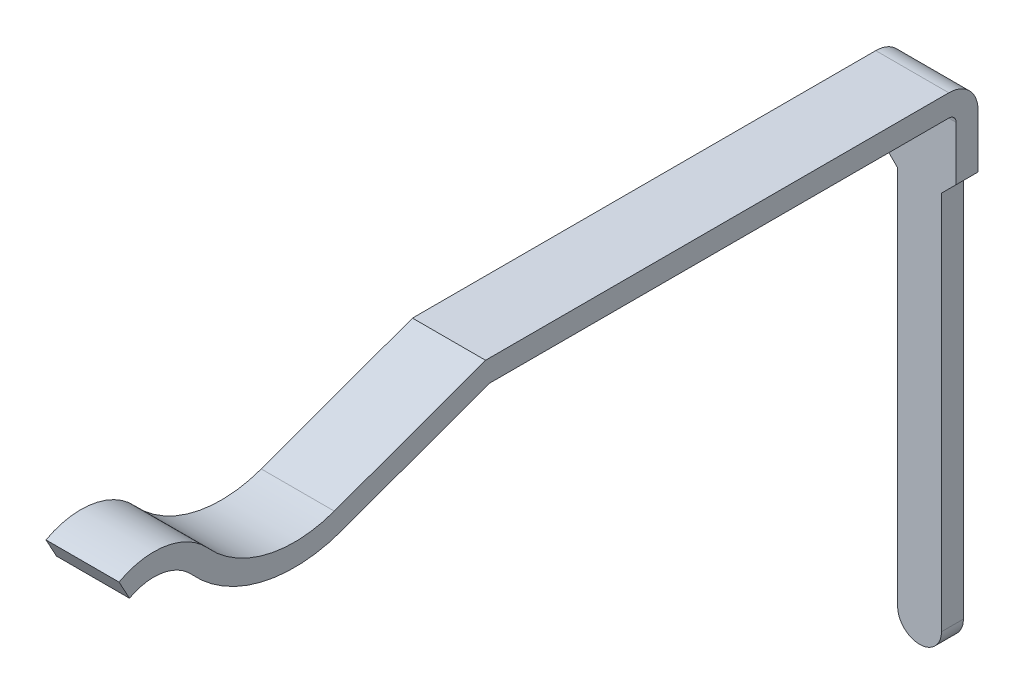
ISO-10303-21;
HEADER;
FILE_DESCRIPTION(('STEP AP214'),'2;1');
FILE_NAME('part.step','',(''),(''),'','','');
FILE_SCHEMA(('AUTOMOTIVE_DESIGN { 1 0 10303 214 1 1 1 1 }'));
ENDSEC;
DATA;
#1=APPLICATION_CONTEXT('core data for automotive mechanical design processes');
#2=APPLICATION_PROTOCOL_DEFINITION('international standard','automotive_design',2000,#1);
#3=PRODUCT_CONTEXT('',#1,'mechanical');
#4=PRODUCT('Part','Part','',(#3));
#5=PRODUCT_RELATED_PRODUCT_CATEGORY('part','',(#4));
#6=PRODUCT_DEFINITION_FORMATION('','',#4);
#7=PRODUCT_DEFINITION_CONTEXT('part definition',#1,'design');
#8=PRODUCT_DEFINITION('design','',#6,#7);
#9=PRODUCT_DEFINITION_SHAPE('','',#8);
#10=(LENGTH_UNIT() NAMED_UNIT(*) SI_UNIT(.MILLI.,.METRE.));
#11=(NAMED_UNIT(*) PLANE_ANGLE_UNIT() SI_UNIT($,.RADIAN.));
#12=(NAMED_UNIT(*) SI_UNIT($,.STERADIAN.) SOLID_ANGLE_UNIT());
#13=UNCERTAINTY_MEASURE_WITH_UNIT(LENGTH_MEASURE(1.E-05),#10,'distance_accuracy_value','');
#14=(GEOMETRIC_REPRESENTATION_CONTEXT(3) GLOBAL_UNCERTAINTY_ASSIGNED_CONTEXT((#13)) GLOBAL_UNIT_ASSIGNED_CONTEXT((#10,
#11,#12)) REPRESENTATION_CONTEXT('',''));
#15=CARTESIAN_POINT('',(0.,0.,0.));
#16=DIRECTION('',(0.,0.,1.));
#17=DIRECTION('',(1.,0.,0.));
#18=AXIS2_PLACEMENT_3D('',#15,#16,#17);
#19=CARTESIAN_POINT('',(-0.5,-1.14,-12.76));
#20=DIRECTION('',(-1.,0.,0.));
#21=DIRECTION('',(0.,0.,1.));
#22=AXIS2_PLACEMENT_3D('',#19,#20,#21);
#23=PLANE('',#22);
#24=DIRECTION('',(0.,-0.342020143057909,0.939692620883365));
#25=VECTOR('',#24,1.);
#26=CARTESIAN_POINT('',(-0.5,-0.6677079895,-5.060107671));
#27=LINE('',#26,#25);
#28=CARTESIAN_POINT('',(-0.5,-0.3,-6.07037707));
#29=VERTEX_POINT('',#28);
#30=CARTESIAN_POINT('',(-0.5,-1.03541597932143,-4.04983827195384));
#31=VERTEX_POINT('',#30);
#32=EDGE_CURVE('E219',#29,#31,#27,.T.);
#33=ORIENTED_EDGE('',*,*,#32,.T.);
#34=CARTESIAN_POINT('',(-0.5,0.75,-3.4));
#35=DIRECTION('',(-1.,0.,0.));
#36=DIRECTION('',(0.,0.,1.));
#37=AXIS2_PLACEMENT_3D('',#34,#35,#36);
#38=CIRCLE('',#37,1.9);
#39=CARTESIAN_POINT('',(-0.5,-0.528846153737504,-1.99481228475666));
#40=VERTEX_POINT('',#39);
#41=EDGE_CURVE('E313',#31,#40,#38,.T.);
#42=ORIENTED_EDGE('',*,*,#41,.T.);
#43=CARTESIAN_POINT('',(-0.5,-1.,-1.477111548));
#44=DIRECTION('',(-1.,0.,0.));
#45=DIRECTION('',(0.,0.,1.));
#46=AXIS2_PLACEMENT_3D('',#43,#44,#45);
#47=CIRCLE('',#46,0.7);
#48=CARTESIAN_POINT('',(-0.5,-0.384810078226828,-1.14313346412314));
#49=VERTEX_POINT('',#48);
#50=EDGE_CURVE('E275',#49,#40,#47,.T.);
#51=ORIENTED_EDGE('',*,*,#50,.F.);
#52=DIRECTION('',(0.,-0.878842745322893,-0.477111547746772));
#53=VECTOR('',#52,1.);
#54=CARTESIAN_POINT('',(-0.5,-0.2529836665,-1.071566732));
#55=LINE('',#54,#53);
#56=CARTESIAN_POINT('',(-0.5,-0.121157254764434,-1.00000000009237));
#57=VERTEX_POINT('',#56);
#58=EDGE_CURVE('E253',#57,#49,#55,.T.);
#59=ORIENTED_EDGE('',*,*,#58,.F.);
#60=CARTESIAN_POINT('',(-0.5,-1.,-1.477111548));
#61=DIRECTION('',(-1.,0.,0.));
#62=DIRECTION('',(0.,0.,1.));
#63=AXIS2_PLACEMENT_3D('',#60,#61,#62);
#64=CIRCLE('',#63,1.);
#65=CARTESIAN_POINT('',(-0.5,-0.326923076831582,-2.21668402926877));
#66=VERTEX_POINT('',#65);
#67=EDGE_CURVE('E250',#57,#66,#64,.T.);
#68=ORIENTED_EDGE('',*,*,#67,.T.);
#69=CARTESIAN_POINT('',(-0.5,0.75,-3.4));
#70=DIRECTION('',(-1.,0.,0.));
#71=DIRECTION('',(0.,0.,1.));
#72=AXIS2_PLACEMENT_3D('',#69,#70,#71);
#73=CIRCLE('',#72,1.6);
#74=CARTESIAN_POINT('',(-0.5,-0.753508193021166,-3.94723222894185));
#75=VERTEX_POINT('',#74);
#76=EDGE_CURVE('E246',#75,#66,#73,.T.);
#77=ORIENTED_EDGE('',*,*,#76,.F.);
#78=DIRECTION('',(0.,-0.342020143127497,0.939692620858037));
#79=VECTOR('',#78,1.);
#80=CARTESIAN_POINT('',(-0.5,-0.3767540965,-4.9823556025));
#81=LINE('',#80,#79);
#82=CARTESIAN_POINT('',(-0.5,0.,-6.017478976));
#83=VERTEX_POINT('',#82);
#84=EDGE_CURVE('E243',#83,#75,#81,.T.);
#85=ORIENTED_EDGE('',*,*,#84,.F.);
#86=DIRECTION('',(0.,0.,1.));
#87=VECTOR('',#86,1.);
#88=CARTESIAN_POINT('',(-0.5,0.,-9.188739488));
#89=LINE('',#88,#87);
#90=CARTESIAN_POINT('',(-0.5,0.,-12.360000000041));
#91=VERTEX_POINT('',#90);
#92=EDGE_CURVE('E238',#91,#83,#89,.T.);
#93=ORIENTED_EDGE('',*,*,#92,.F.);
#94=CARTESIAN_POINT('',(-0.5,-0.4,-12.36));
#95=DIRECTION('',(-1.,0.,0.));
#96=DIRECTION('',(0.,0.,1.));
#97=AXIS2_PLACEMENT_3D('',#94,#95,#96);
#98=CIRCLE('',#97,0.399999999999999);
#99=CARTESIAN_POINT('',(-0.5,-0.4,-12.76));
#100=VERTEX_POINT('',#99);
#101=EDGE_CURVE('E21',#91,#100,#98,.T.);
#102=ORIENTED_EDGE('',*,*,#101,.T.);
#103=DIRECTION('',(0.,-1.,0.));
#104=VECTOR('',#103,1.);
#105=CARTESIAN_POINT('',(-0.5,-0.5643,-12.76));
#106=LINE('',#105,#104);
#107=CARTESIAN_POINT('',(-0.50000000015034,-1.13999999984966,-12.76));
#108=VERTEX_POINT('',#107);
#109=EDGE_CURVE('E129',#100,#108,#106,.T.);
#110=ORIENTED_EDGE('',*,*,#109,.T.);
#111=DIRECTION('',(0.,0.,1.));
#112=VECTOR('',#111,1.);
#113=CARTESIAN_POINT('',(-0.5,-1.14,-6.84472));
#114=LINE('',#113,#112);
#115=CARTESIAN_POINT('',(-0.5,-1.14,-12.4599999985043));
#116=VERTEX_POINT('',#115);
#117=EDGE_CURVE('E264',#108,#116,#114,.T.);
#118=ORIENTED_EDGE('',*,*,#117,.T.);
#119=DIRECTION('',(0.,1.,0.));
#120=VECTOR('',#119,1.);
#121=CARTESIAN_POINT('',(-0.5,-0.5643,-12.4599999970086));
#122=LINE('',#121,#120);
#123=CARTESIAN_POINT('',(-0.5,-0.4,-12.4599999985043));
#124=VERTEX_POINT('',#123);
#125=EDGE_CURVE('E261',#116,#124,#122,.T.);
#126=ORIENTED_EDGE('',*,*,#125,.T.);
#127=CARTESIAN_POINT('',(-0.5,-0.4,-12.36));
#128=DIRECTION('',(-1.,0.,0.));
#129=DIRECTION('',(0.,0.,1.));
#130=AXIS2_PLACEMENT_3D('',#127,#128,#129);
#131=CIRCLE('',#130,0.100000000000001);
#132=CARTESIAN_POINT('',(-0.5,-0.3,-12.36));
#133=VERTEX_POINT('',#132);
#134=EDGE_CURVE('E263',#124,#133,#131,.F.);
#135=ORIENTED_EDGE('',*,*,#134,.T.);
#136=DIRECTION('',(0.,0.,1.));
#137=VECTOR('',#136,1.);
#138=CARTESIAN_POINT('',(-0.5,-0.3,-9.215188535));
#139=LINE('',#138,#137);
#140=EDGE_CURVE('E223',#133,#29,#139,.T.);
#141=ORIENTED_EDGE('',*,*,#140,.T.);
#142=EDGE_LOOP('',(#33,#42,#51,#59,#68,#77,#85,#93,#102,#110,#118,#126,#135,#141));
#143=FACE_BOUND('',#142,.T.);
#144=ADVANCED_FACE('F17',(#143),#23,.T.);
#145=CARTESIAN_POINT('',(0.5,-1.,-1.477111548));
#146=DIRECTION('',(-1.,0.,0.));
#147=DIRECTION('',(0.,0.,1.));
#148=AXIS2_PLACEMENT_3D('',#145,#146,#147);
#149=CYLINDRICAL_SURFACE('',#148,0.7);
#150=CARTESIAN_POINT('',(0.5,-1.,-1.477111548));
#151=DIRECTION('',(-1.,0.,0.));
#152=DIRECTION('',(0.,0.,1.));
#153=AXIS2_PLACEMENT_3D('',#150,#151,#152);
#154=CIRCLE('',#153,0.7);
#155=CARTESIAN_POINT('',(0.5,-0.528846153662103,-1.99481228483951));
#156=VERTEX_POINT('',#155);
#157=CARTESIAN_POINT('',(0.5,-0.384810078226828,-1.14313346412314));
#158=VERTEX_POINT('',#157);
#159=EDGE_CURVE('E236',#156,#158,#154,.F.);
#160=ORIENTED_EDGE('',*,*,#159,.T.);
#161=DIRECTION('',(1.,0.,0.));
#162=VECTOR('',#161,1.);
#163=CARTESIAN_POINT('',(0.,-0.384810078,-1.143133464));
#164=LINE('',#163,#162);
#165=EDGE_CURVE('E251',#49,#158,#164,.T.);
#166=ORIENTED_EDGE('',*,*,#165,.F.);
#167=ORIENTED_EDGE('',*,*,#50,.T.);
#168=DIRECTION('',(-1.,0.,0.));
#169=VECTOR('',#168,1.);
#170=CARTESIAN_POINT('',(0.,-0.528846153518653,-1.99481228455749));
#171=LINE('',#170,#169);
#172=EDGE_CURVE('E212',#40,#156,#171,.F.);
#173=ORIENTED_EDGE('',*,*,#172,.T.);
#174=EDGE_LOOP('',(#160,#166,#167,#173));
#175=FACE_BOUND('',#174,.T.);
#176=ADVANCED_FACE('F337',(#175),#149,.F.);
#177=CARTESIAN_POINT('',(-0.5,-0.121157255,-1.));
#178=DIRECTION('',(0.,-0.477111547746772,0.878842745322893));
#179=DIRECTION('',(0.,-0.878842745322893,-0.477111547746772));
#180=AXIS2_PLACEMENT_3D('',#177,#178,#179);
#181=PLANE('',#180);
#182=DIRECTION('',(0.,-0.878842745322893,-0.477111547746772));
#183=VECTOR('',#182,1.);
#184=CARTESIAN_POINT('',(0.5,-0.121157255,-1.));
#185=LINE('',#184,#183);
#186=CARTESIAN_POINT('',(0.5,-0.121157254764434,-1.00000000009237));
#187=VERTEX_POINT('',#186);
#188=EDGE_CURVE('E303',#158,#187,#185,.F.);
#189=ORIENTED_EDGE('',*,*,#188,.T.);
#190=DIRECTION('',(1.,0.,0.));
#191=VECTOR('',#190,1.);
#192=CARTESIAN_POINT('',(0.,-0.121157254672079,-1.00000000026249));
#193=LINE('',#192,#191);
#194=EDGE_CURVE('E247',#187,#57,#193,.F.);
#195=ORIENTED_EDGE('',*,*,#194,.T.);
#196=ORIENTED_EDGE('',*,*,#58,.T.);
#197=ORIENTED_EDGE('',*,*,#165,.T.);
#198=EDGE_LOOP('',(#189,#195,#196,#197));
#199=FACE_BOUND('',#198,.T.);
#200=ADVANCED_FACE('F377',(#199),#181,.T.);
#201=CARTESIAN_POINT('',(0.5,-1.,-1.477111548));
#202=DIRECTION('',(-1.,0.,0.));
#203=DIRECTION('',(0.,0.,1.));
#204=AXIS2_PLACEMENT_3D('',#201,#202,#203);
#205=CYLINDRICAL_SURFACE('',#204,1.);
#206=ORIENTED_EDGE('',*,*,#194,.F.);
#207=CARTESIAN_POINT('',(0.5,-1.,-1.477111548));
#208=DIRECTION('',(-1.,0.,0.));
#209=DIRECTION('',(0.,0.,1.));
#210=AXIS2_PLACEMENT_3D('',#207,#208,#209);
#211=CIRCLE('',#210,1.);
#212=CARTESIAN_POINT('',(0.5,-0.326923076831582,-2.21668402926877));
#213=VERTEX_POINT('',#212);
#214=EDGE_CURVE('E300',#187,#213,#211,.T.);
#215=ORIENTED_EDGE('',*,*,#214,.T.);
#216=DIRECTION('',(-1.,0.,0.));
#217=VECTOR('',#216,1.);
#218=CARTESIAN_POINT('',(0.,-0.326923076647287,-2.21668402910104));
#219=LINE('',#218,#217);
#220=EDGE_CURVE('E244',#66,#213,#219,.F.);
#221=ORIENTED_EDGE('',*,*,#220,.F.);
#222=ORIENTED_EDGE('',*,*,#67,.F.);
#223=EDGE_LOOP('',(#206,#215,#221,#222));
#224=FACE_BOUND('',#223,.T.);
#225=ADVANCED_FACE('F374',(#224),#205,.T.);
#226=CARTESIAN_POINT('',(0.5,0.75,-3.4));
#227=DIRECTION('',(-1.,0.,0.));
#228=DIRECTION('',(0.,0.,1.));
#229=AXIS2_PLACEMENT_3D('',#226,#227,#228);
#230=CYLINDRICAL_SURFACE('',#229,1.6);
#231=CARTESIAN_POINT('',(0.5,0.75,-3.4));
#232=DIRECTION('',(-1.,0.,0.));
#233=DIRECTION('',(0.,0.,1.));
#234=AXIS2_PLACEMENT_3D('',#231,#232,#233);
#235=CIRCLE('',#234,1.6);
#236=CARTESIAN_POINT('',(0.5,-0.753508193021166,-3.94723222894185));
#237=VERTEX_POINT('',#236);
#238=EDGE_CURVE('E297',#213,#237,#235,.F.);
#239=ORIENTED_EDGE('',*,*,#238,.T.);
#240=DIRECTION('',(1.,0.,0.));
#241=VECTOR('',#240,1.);
#242=CARTESIAN_POINT('',(0.,-0.753508193,-3.947232229));
#243=LINE('',#242,#241);
#244=EDGE_CURVE('E241',#75,#237,#243,.T.);
#245=ORIENTED_EDGE('',*,*,#244,.F.);
#246=ORIENTED_EDGE('',*,*,#76,.T.);
#247=ORIENTED_EDGE('',*,*,#220,.T.);
#248=EDGE_LOOP('',(#239,#245,#246,#247));
#249=FACE_BOUND('',#248,.T.);
#250=ADVANCED_FACE('F370',(#249),#230,.F.);
#251=CARTESIAN_POINT('',(-0.5,0.,-6.017478976));
#252=DIRECTION('',(0.,0.939692620858037,0.342020143127497));
#253=DIRECTION('',(0.,-0.342020143127497,0.939692620858037));
#254=AXIS2_PLACEMENT_3D('',#251,#252,#253);
#255=PLANE('',#254);
#256=DIRECTION('',(0.,-0.342020143127497,0.939692620858037));
#257=VECTOR('',#256,1.);
#258=CARTESIAN_POINT('',(0.5,0.,-6.017478976));
#259=LINE('',#258,#257);
#260=CARTESIAN_POINT('',(0.5,0.,-6.017478976));
#261=VERTEX_POINT('',#260);
#262=EDGE_CURVE('E206',#237,#261,#259,.F.);
#263=ORIENTED_EDGE('',*,*,#262,.T.);
#264=DIRECTION('',(1.,0.,0.));
#265=VECTOR('',#264,1.);
#266=CARTESIAN_POINT('',(0.,0.,-6.017478976));
#267=LINE('',#266,#265);
#268=EDGE_CURVE('E229',#83,#261,#267,.T.);
#269=ORIENTED_EDGE('',*,*,#268,.F.);
#270=ORIENTED_EDGE('',*,*,#84,.T.);
#271=ORIENTED_EDGE('',*,*,#244,.T.);
#272=EDGE_LOOP('',(#263,#269,#270,#271));
#273=FACE_BOUND('',#272,.T.);
#274=ADVANCED_FACE('F364',(#273),#255,.T.);
#275=CARTESIAN_POINT('',(-0.5,0.,-12.36));
#276=DIRECTION('',(0.,1.,0.));
#277=DIRECTION('',(0.,0.,1.));
#278=AXIS2_PLACEMENT_3D('',#275,#276,#277);
#279=PLANE('',#278);
#280=DIRECTION('',(0.,0.,-1.));
#281=VECTOR('',#280,1.);
#282=CARTESIAN_POINT('',(0.5,0.,-6.84472));
#283=LINE('',#282,#281);
#284=CARTESIAN_POINT('',(0.5,0.,-12.360000000041));
#285=VERTEX_POINT('',#284);
#286=EDGE_CURVE('E202',#261,#285,#283,.T.);
#287=ORIENTED_EDGE('',*,*,#286,.T.);
#288=DIRECTION('',(1.,0.,0.));
#289=VECTOR('',#288,1.);
#290=CARTESIAN_POINT('',(0.,0.,-12.360000000082));
#291=LINE('',#290,#289);
#292=EDGE_CURVE('E215',#285,#91,#291,.F.);
#293=ORIENTED_EDGE('',*,*,#292,.T.);
#294=ORIENTED_EDGE('',*,*,#92,.T.);
#295=ORIENTED_EDGE('',*,*,#268,.T.);
#296=EDGE_LOOP('',(#287,#293,#294,#295));
#297=FACE_BOUND('',#296,.T.);
#298=ADVANCED_FACE('F360',(#297),#279,.T.);
#299=CARTESIAN_POINT('',(-0.5,-0.3,-12.36));
#300=DIRECTION('',(0.,1.,0.));
#301=DIRECTION('',(0.,0.,1.));
#302=AXIS2_PLACEMENT_3D('',#299,#300,#301);
#303=PLANE('',#302);
#304=DIRECTION('',(-1.,0.,0.));
#305=VECTOR('',#304,1.);
#306=CARTESIAN_POINT('',(0.,-0.3,-12.36));
#307=LINE('',#306,#305);
#308=CARTESIAN_POINT('',(0.5,-0.30000000015,-12.36));
#309=VERTEX_POINT('',#308);
#310=EDGE_CURVE('E226',#309,#133,#307,.T.);
#311=ORIENTED_EDGE('',*,*,#310,.F.);
#312=DIRECTION('',(0.,0.,1.));
#313=VECTOR('',#312,1.);
#314=CARTESIAN_POINT('',(0.5,-0.3000000003,-6.84472));
#315=LINE('',#314,#313);
#316=CARTESIAN_POINT('',(0.5,-0.30000000015,-6.07037706958788));
#317=VERTEX_POINT('',#316);
#318=EDGE_CURVE('E193',#309,#317,#315,.T.);
#319=ORIENTED_EDGE('',*,*,#318,.T.);
#320=DIRECTION('',(-1.,0.,0.));
#321=VECTOR('',#320,1.);
#322=CARTESIAN_POINT('',(0.,-0.3,-6.07037707));
#323=LINE('',#322,#321);
#324=EDGE_CURVE('E220',#317,#29,#323,.T.);
#325=ORIENTED_EDGE('',*,*,#324,.T.);
#326=ORIENTED_EDGE('',*,*,#140,.F.);
#327=EDGE_LOOP('',(#311,#319,#325,#326));
#328=FACE_BOUND('',#327,.T.);
#329=ADVANCED_FACE('F322',(#328),#303,.F.);
#330=CARTESIAN_POINT('',(-0.5,-0.3,-6.07037707));
#331=DIRECTION('',(0.,0.939692620883365,0.342020143057909));
#332=DIRECTION('',(0.,-0.342020143057909,0.939692620883365));
#333=AXIS2_PLACEMENT_3D('',#330,#331,#332);
#334=PLANE('',#333);
#335=ORIENTED_EDGE('',*,*,#324,.F.);
#336=DIRECTION('',(0.,-0.342020143057909,0.939692620883365));
#337=VECTOR('',#336,1.);
#338=CARTESIAN_POINT('',(0.5,-0.3,-6.07037707));
#339=LINE('',#338,#337);
#340=CARTESIAN_POINT('',(0.5,-1.03541597932143,-4.04983827195384));
#341=VERTEX_POINT('',#340);
#342=EDGE_CURVE('E196',#317,#341,#339,.T.);
#343=ORIENTED_EDGE('',*,*,#342,.T.);
#344=DIRECTION('',(1.,0.,0.));
#345=VECTOR('',#344,1.);
#346=CARTESIAN_POINT('',(0.,-1.03541597950244,-4.04983827229346));
#347=LINE('',#346,#345);
#348=EDGE_CURVE('E216',#341,#31,#347,.F.);
#349=ORIENTED_EDGE('',*,*,#348,.T.);
#350=ORIENTED_EDGE('',*,*,#32,.F.);
#351=EDGE_LOOP('',(#335,#343,#349,#350));
#352=FACE_BOUND('',#351,.T.);
#353=ADVANCED_FACE('F331',(#352),#334,.F.);
#354=CARTESIAN_POINT('',(0.5,0.75,-3.4));
#355=DIRECTION('',(-1.,0.,0.));
#356=DIRECTION('',(0.,0.,1.));
#357=AXIS2_PLACEMENT_3D('',#354,#355,#356);
#358=CYLINDRICAL_SURFACE('',#357,1.9);
#359=ORIENTED_EDGE('',*,*,#348,.F.);
#360=CARTESIAN_POINT('',(0.5,0.75,-3.4));
#361=DIRECTION('',(-1.,0.,0.));
#362=DIRECTION('',(0.,0.,1.));
#363=AXIS2_PLACEMENT_3D('',#360,#361,#362);
#364=CIRCLE('',#363,1.9);
#365=EDGE_CURVE('E208',#341,#156,#364,.T.);
#366=ORIENTED_EDGE('',*,*,#365,.T.);
#367=ORIENTED_EDGE('',*,*,#172,.F.);
#368=ORIENTED_EDGE('',*,*,#41,.F.);
#369=EDGE_LOOP('',(#359,#366,#367,#368));
#370=FACE_BOUND('',#369,.T.);
#371=ADVANCED_FACE('F338',(#370),#358,.T.);
#372=CARTESIAN_POINT('',(0.5,-0.4,-12.36));
#373=DIRECTION('',(-1.,0.,0.));
#374=DIRECTION('',(0.,0.,1.));
#375=AXIS2_PLACEMENT_3D('',#372,#373,#374);
#376=CYLINDRICAL_SURFACE('',#375,0.399999999999999);
#377=ORIENTED_EDGE('',*,*,#292,.F.);
#378=CARTESIAN_POINT('',(0.5,-0.4,-12.36));
#379=DIRECTION('',(-1.,0.,0.));
#380=DIRECTION('',(0.,0.,1.));
#381=AXIS2_PLACEMENT_3D('',#378,#379,#380);
#382=CIRCLE('',#381,0.399999999999999);
#383=CARTESIAN_POINT('',(0.5,-0.4,-12.76));
#384=VERTEX_POINT('',#383);
#385=EDGE_CURVE('E205',#285,#384,#382,.T.);
#386=ORIENTED_EDGE('',*,*,#385,.T.);
#387=DIRECTION('',(1.,0.,0.));
#388=VECTOR('',#387,1.);
#389=CARTESIAN_POINT('',(0.,-0.4,-12.76));
#390=LINE('',#389,#388);
#391=EDGE_CURVE('E184',#100,#384,#390,.T.);
#392=ORIENTED_EDGE('',*,*,#391,.F.);
#393=ORIENTED_EDGE('',*,*,#101,.F.);
#394=EDGE_LOOP('',(#377,#386,#392,#393));
#395=FACE_BOUND('',#394,.T.);
#396=ADVANCED_FACE('F340',(#395),#376,.T.);
#397=CARTESIAN_POINT('',(0.5,-1.14,-12.76));
#398=DIRECTION('',(-1.,0.,0.));
#399=DIRECTION('',(0.,0.,1.));
#400=AXIS2_PLACEMENT_3D('',#397,#398,#399);
#401=PLANE('',#400);
#402=ORIENTED_EDGE('',*,*,#365,.F.);
#403=ORIENTED_EDGE('',*,*,#342,.F.);
#404=ORIENTED_EDGE('',*,*,#318,.F.);
#405=CARTESIAN_POINT('',(0.5,-0.4,-12.36));
#406=DIRECTION('',(-1.,0.,0.));
#407=DIRECTION('',(0.,0.,1.));
#408=AXIS2_PLACEMENT_3D('',#405,#406,#407);
#409=CIRCLE('',#408,0.100000000000001);
#410=CARTESIAN_POINT('',(0.5,-0.4,-12.4599999985043));
#411=VERTEX_POINT('',#410);
#412=EDGE_CURVE('E197',#411,#309,#409,.F.);
#413=ORIENTED_EDGE('',*,*,#412,.F.);
#414=DIRECTION('',(0.,1.,0.));
#415=VECTOR('',#414,1.);
#416=CARTESIAN_POINT('',(0.5,-0.5643,-12.4599999970086));
#417=LINE('',#416,#415);
#418=CARTESIAN_POINT('',(0.5,-1.14,-12.4599999985043));
#419=VERTEX_POINT('',#418);
#420=EDGE_CURVE('E198',#419,#411,#417,.T.);
#421=ORIENTED_EDGE('',*,*,#420,.F.);
#422=DIRECTION('',(0.,0.,1.));
#423=VECTOR('',#422,1.);
#424=CARTESIAN_POINT('',(0.5,-1.14,-6.84472));
#425=LINE('',#424,#423);
#426=CARTESIAN_POINT('',(0.5,-1.14,-12.76));
#427=VERTEX_POINT('',#426);
#428=EDGE_CURVE('E201',#427,#419,#425,.T.);
#429=ORIENTED_EDGE('',*,*,#428,.F.);
#430=DIRECTION('',(0.,-1.,0.));
#431=VECTOR('',#430,1.);
#432=CARTESIAN_POINT('',(0.5,-3.63932,-12.76));
#433=LINE('',#432,#431);
#434=EDGE_CURVE('E150',#384,#427,#433,.T.);
#435=ORIENTED_EDGE('',*,*,#434,.F.);
#436=ORIENTED_EDGE('',*,*,#385,.F.);
#437=ORIENTED_EDGE('',*,*,#286,.F.);
#438=ORIENTED_EDGE('',*,*,#262,.F.);
#439=ORIENTED_EDGE('',*,*,#238,.F.);
#440=ORIENTED_EDGE('',*,*,#214,.F.);
#441=ORIENTED_EDGE('',*,*,#188,.F.);
#442=ORIENTED_EDGE('',*,*,#159,.F.);
#443=EDGE_LOOP('',(#402,#403,#404,#413,#421,#429,#435,#436,#437,#438,#439,#440,#441,#442));
#444=FACE_BOUND('',#443,.T.);
#445=ADVANCED_FACE('F327',(#444),#401,.F.);
#446=CARTESIAN_POINT('',(-0.5,-6.87864,-12.76));
#447=DIRECTION('',(0.,0.,-1.));
#448=DIRECTION('',(0.,1.,0.));
#449=AXIS2_PLACEMENT_3D('',#446,#447,#448);
#450=PLANE('',#449);
#451=ORIENTED_EDGE('',*,*,#391,.T.);
#452=ORIENTED_EDGE('',*,*,#434,.T.);
#453=DIRECTION('',(-0.707106781186548,-0.707106781186547,0.));
#454=VECTOR('',#453,1.);
#455=CARTESIAN_POINT('',(0.4,-1.24,-12.76));
#456=LINE('',#455,#454);
#457=CARTESIAN_POINT('',(0.3,-1.34,-12.76));
#458=VERTEX_POINT('',#457);
#459=EDGE_CURVE('E146',#427,#458,#456,.T.);
#460=ORIENTED_EDGE('',*,*,#459,.T.);
#461=DIRECTION('',(0.,-1.,0.));
#462=VECTOR('',#461,1.);
#463=CARTESIAN_POINT('',(0.3,-3.94,-12.76));
#464=LINE('',#463,#462);
#465=CARTESIAN_POINT('',(0.3,-6.54,-12.76));
#466=VERTEX_POINT('',#465);
#467=EDGE_CURVE('E148',#458,#466,#464,.T.);
#468=ORIENTED_EDGE('',*,*,#467,.T.);
#469=CARTESIAN_POINT('',(0.,-6.54,-12.76));
#470=DIRECTION('',(0.,0.,1.));
#471=DIRECTION('',(0.,-1.,0.));
#472=AXIS2_PLACEMENT_3D('',#469,#470,#471);
#473=CIRCLE('',#472,0.3);
#474=CARTESIAN_POINT('',(-0.3,-6.54,-12.76));
#475=VERTEX_POINT('',#474);
#476=EDGE_CURVE('E173',#466,#475,#473,.F.);
#477=ORIENTED_EDGE('',*,*,#476,.T.);
#478=DIRECTION('',(0.,1.,0.));
#479=VECTOR('',#478,1.);
#480=CARTESIAN_POINT('',(-0.3,-3.94,-12.76));
#481=LINE('',#480,#479);
#482=CARTESIAN_POINT('',(-0.299999999913733,-1.3400000002588,-12.76));
#483=VERTEX_POINT('',#482);
#484=EDGE_CURVE('E172',#475,#483,#481,.T.);
#485=ORIENTED_EDGE('',*,*,#484,.T.);
#486=DIRECTION('',(-0.707106781186548,0.707106781186547,0.));
#487=VECTOR('',#486,1.);
#488=CARTESIAN_POINT('',(-0.4,-1.24,-12.76));
#489=LINE('',#488,#487);
#490=EDGE_CURVE('E153',#483,#108,#489,.T.);
#491=ORIENTED_EDGE('',*,*,#490,.T.);
#492=ORIENTED_EDGE('',*,*,#109,.F.);
#493=EDGE_LOOP('',(#451,#452,#460,#468,#477,#485,#491,#492));
#494=FACE_BOUND('',#493,.T.);
#495=ADVANCED_FACE('F147',(#494),#450,.T.);
#496=CARTESIAN_POINT('',(0.,-6.54,-12.76));
#497=DIRECTION('',(0.,0.,1.));
#498=DIRECTION('',(0.,-1.,0.));
#499=AXIS2_PLACEMENT_3D('',#496,#497,#498);
#500=CYLINDRICAL_SURFACE('',#499,0.3);
#501=ORIENTED_EDGE('',*,*,#476,.F.);
#502=DIRECTION('',(0.,0.,1.));
#503=VECTOR('',#502,1.);
#504=CARTESIAN_POINT('',(0.3,-6.54,-12.61));
#505=LINE('',#504,#503);
#506=CARTESIAN_POINT('',(0.3,-6.54,-12.46));
#507=VERTEX_POINT('',#506);
#508=EDGE_CURVE('E158',#466,#507,#505,.T.);
#509=ORIENTED_EDGE('',*,*,#508,.T.);
#510=CARTESIAN_POINT('',(0.,-6.54,-12.46));
#511=DIRECTION('',(0.,0.,1.));
#512=DIRECTION('',(0.,-1.,0.));
#513=AXIS2_PLACEMENT_3D('',#510,#511,#512);
#514=CIRCLE('',#513,0.3);
#515=CARTESIAN_POINT('',(-0.3,-6.54,-12.46));
#516=VERTEX_POINT('',#515);
#517=EDGE_CURVE('E283',#507,#516,#514,.F.);
#518=ORIENTED_EDGE('',*,*,#517,.T.);
#519=DIRECTION('',(0.,0.,-1.));
#520=VECTOR('',#519,1.);
#521=CARTESIAN_POINT('',(-0.3,-6.54,-12.61));
#522=LINE('',#521,#520);
#523=EDGE_CURVE('E169',#516,#475,#522,.T.);
#524=ORIENTED_EDGE('',*,*,#523,.T.);
#525=EDGE_LOOP('',(#501,#509,#518,#524));
#526=FACE_BOUND('',#525,.T.);
#527=ADVANCED_FACE('F398',(#526),#500,.T.);
#528=CARTESIAN_POINT('',(-0.3,-6.54,-12.76));
#529=DIRECTION('',(1.,0.,0.));
#530=DIRECTION('',(0.,1.,0.));
#531=AXIS2_PLACEMENT_3D('',#528,#529,#530);
#532=PLANE('',#531);
#533=ORIENTED_EDGE('',*,*,#484,.F.);
#534=ORIENTED_EDGE('',*,*,#523,.F.);
#535=DIRECTION('',(0.,1.,0.));
#536=VECTOR('',#535,1.);
#537=CARTESIAN_POINT('',(-0.3,-3.63932,-12.46));
#538=LINE('',#537,#536);
#539=CARTESIAN_POINT('',(-0.3,-1.34,-12.46));
#540=VERTEX_POINT('',#539);
#541=EDGE_CURVE('E282',#516,#540,#538,.T.);
#542=ORIENTED_EDGE('',*,*,#541,.T.);
#543=DIRECTION('',(0.,0.,-1.));
#544=VECTOR('',#543,1.);
#545=CARTESIAN_POINT('',(-0.3,-1.34,-12.61));
#546=LINE('',#545,#544);
#547=EDGE_CURVE('E174',#540,#483,#546,.T.);
#548=ORIENTED_EDGE('',*,*,#547,.T.);
#549=EDGE_LOOP('',(#533,#534,#542,#548));
#550=FACE_BOUND('',#549,.T.);
#551=ADVANCED_FACE('F399',(#550),#532,.F.);
#552=CARTESIAN_POINT('',(-0.3,-1.34,-12.76));
#553=DIRECTION('',(0.707106781186547,0.707106781186548,0.));
#554=DIRECTION('',(-0.707106781186548,0.707106781186547,0.));
#555=AXIS2_PLACEMENT_3D('',#552,#553,#554);
#556=PLANE('',#555);
#557=ORIENTED_EDGE('',*,*,#490,.F.);
#558=ORIENTED_EDGE('',*,*,#547,.F.);
#559=DIRECTION('',(-0.707106781186548,0.707106781186547,0.));
#560=VECTOR('',#559,1.);
#561=CARTESIAN_POINT('',(-0.3,-1.34,-12.46));
#562=LINE('',#561,#560);
#563=EDGE_CURVE('E233',#540,#116,#562,.T.);
#564=ORIENTED_EDGE('',*,*,#563,.T.);
#565=ORIENTED_EDGE('',*,*,#117,.F.);
#566=EDGE_LOOP('',(#557,#558,#564,#565));
#567=FACE_BOUND('',#566,.T.);
#568=ADVANCED_FACE('F402',(#567),#556,.F.);
#569=CARTESIAN_POINT('',(0.5,-0.4,-12.36));
#570=DIRECTION('',(-1.,0.,0.));
#571=DIRECTION('',(0.,0.,1.));
#572=AXIS2_PLACEMENT_3D('',#569,#570,#571);
#573=CYLINDRICAL_SURFACE('',#572,0.100000000000001);
#574=ORIENTED_EDGE('',*,*,#412,.T.);
#575=ORIENTED_EDGE('',*,*,#310,.T.);
#576=ORIENTED_EDGE('',*,*,#134,.F.);
#577=DIRECTION('',(1.,0.,0.));
#578=VECTOR('',#577,1.);
#579=CARTESIAN_POINT('',(0.,-0.4,-12.46));
#580=LINE('',#579,#578);
#581=EDGE_CURVE('E230',#124,#411,#580,.T.);
#582=ORIENTED_EDGE('',*,*,#581,.T.);
#583=EDGE_LOOP('',(#574,#575,#576,#582));
#584=FACE_BOUND('',#583,.T.);
#585=ADVANCED_FACE('F324',(#584),#573,.F.);
#586=CARTESIAN_POINT('',(0.5,-1.14,-12.76));
#587=DIRECTION('',(-0.707106781186547,0.707106781186548,0.));
#588=DIRECTION('',(-0.707106781186548,-0.707106781186547,0.));
#589=AXIS2_PLACEMENT_3D('',#586,#587,#588);
#590=PLANE('',#589);
#591=ORIENTED_EDGE('',*,*,#459,.F.);
#592=ORIENTED_EDGE('',*,*,#428,.T.);
#593=DIRECTION('',(-0.707106781186548,-0.707106781186547,0.));
#594=VECTOR('',#593,1.);
#595=CARTESIAN_POINT('',(0.5,-1.14,-12.46));
#596=LINE('',#595,#594);
#597=CARTESIAN_POINT('',(0.3,-1.34,-12.46));
#598=VERTEX_POINT('',#597);
#599=EDGE_CURVE('E27',#419,#598,#596,.T.);
#600=ORIENTED_EDGE('',*,*,#599,.T.);
#601=DIRECTION('',(0.,0.,-1.));
#602=VECTOR('',#601,1.);
#603=CARTESIAN_POINT('',(0.3,-1.34,-12.61));
#604=LINE('',#603,#602);
#605=EDGE_CURVE('E35',#598,#458,#604,.T.);
#606=ORIENTED_EDGE('',*,*,#605,.T.);
#607=EDGE_LOOP('',(#591,#592,#600,#606));
#608=FACE_BOUND('',#607,.T.);
#609=ADVANCED_FACE('F161',(#608),#590,.F.);
#610=CARTESIAN_POINT('',(0.3,-1.34,-12.76));
#611=DIRECTION('',(-1.,0.,0.));
#612=DIRECTION('',(0.,-1.,0.));
#613=AXIS2_PLACEMENT_3D('',#610,#611,#612);
#614=PLANE('',#613);
#615=ORIENTED_EDGE('',*,*,#467,.F.);
#616=ORIENTED_EDGE('',*,*,#605,.F.);
#617=DIRECTION('',(0.,-1.,0.));
#618=VECTOR('',#617,1.);
#619=CARTESIAN_POINT('',(0.3,-3.63932,-12.46));
#620=LINE('',#619,#618);
#621=EDGE_CURVE('E11',#598,#507,#620,.T.);
#622=ORIENTED_EDGE('',*,*,#621,.T.);
#623=ORIENTED_EDGE('',*,*,#508,.F.);
#624=EDGE_LOOP('',(#615,#616,#622,#623));
#625=FACE_BOUND('',#624,.T.);
#626=ADVANCED_FACE('F156',(#625),#614,.F.);
#627=CARTESIAN_POINT('',(-0.5,-6.87864,-12.46));
#628=DIRECTION('',(0.,0.,-1.));
#629=DIRECTION('',(0.,1.,0.));
#630=AXIS2_PLACEMENT_3D('',#627,#628,#629);
#631=PLANE('',#630);
#632=ORIENTED_EDGE('',*,*,#599,.F.);
#633=ORIENTED_EDGE('',*,*,#420,.T.);
#634=ORIENTED_EDGE('',*,*,#581,.F.);
#635=ORIENTED_EDGE('',*,*,#125,.F.);
#636=ORIENTED_EDGE('',*,*,#563,.F.);
#637=ORIENTED_EDGE('',*,*,#541,.F.);
#638=ORIENTED_EDGE('',*,*,#517,.F.);
#639=ORIENTED_EDGE('',*,*,#621,.F.);
#640=EDGE_LOOP('',(#632,#633,#634,#635,#636,#637,#638,#639));
#641=FACE_BOUND('',#640,.T.);
#642=ADVANCED_FACE('F19',(#641),#631,.F.);
#643=CLOSED_SHELL('',(#144,#176,#200,#225,#250,#274,#298,#329,#353,#371,#396,#445,#495,#527,
#551,#568,#585,#609,#626,#642));
#644=MANIFOLD_SOLID_BREP('B1',#643);
#645=ADVANCED_BREP_SHAPE_REPRESENTATION('',(#18,#644),#14);
#646=SHAPE_DEFINITION_REPRESENTATION(#9,#645);
ENDSEC;
END-ISO-10303-21;
